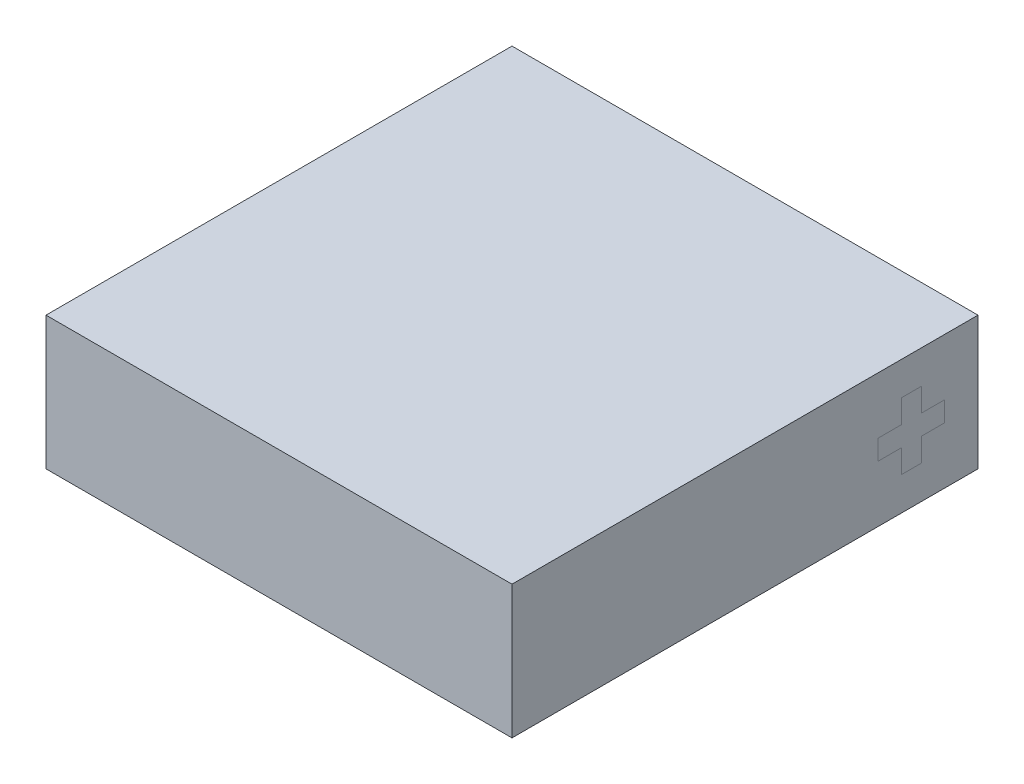
ISO-10303-21;
HEADER;
FILE_DESCRIPTION(('STEP AP214'),'2;1');
FILE_NAME('part.step','',(''),(''),'','','');
FILE_SCHEMA(('AUTOMOTIVE_DESIGN { 1 0 10303 214 1 1 1 1 }'));
ENDSEC;
DATA;
#1=APPLICATION_CONTEXT('core data for automotive mechanical design processes');
#2=APPLICATION_PROTOCOL_DEFINITION('international standard','automotive_design',2000,#1);
#3=PRODUCT_CONTEXT('',#1,'mechanical');
#4=PRODUCT('Part','Part','',(#3));
#5=PRODUCT_RELATED_PRODUCT_CATEGORY('part','',(#4));
#6=PRODUCT_DEFINITION_FORMATION('','',#4);
#7=PRODUCT_DEFINITION_CONTEXT('part definition',#1,'design');
#8=PRODUCT_DEFINITION('design','',#6,#7);
#9=PRODUCT_DEFINITION_SHAPE('','',#8);
#10=(LENGTH_UNIT() NAMED_UNIT(*) SI_UNIT(.MILLI.,.METRE.));
#11=(NAMED_UNIT(*) PLANE_ANGLE_UNIT() SI_UNIT($,.RADIAN.));
#12=(NAMED_UNIT(*) SI_UNIT($,.STERADIAN.) SOLID_ANGLE_UNIT());
#13=UNCERTAINTY_MEASURE_WITH_UNIT(LENGTH_MEASURE(1.E-05),#10,'distance_accuracy_value','');
#14=(GEOMETRIC_REPRESENTATION_CONTEXT(3) GLOBAL_UNCERTAINTY_ASSIGNED_CONTEXT((#13)) GLOBAL_UNIT_ASSIGNED_CONTEXT((#10,
#11,#12)) REPRESENTATION_CONTEXT('',''));
#15=CARTESIAN_POINT('',(0.,0.,0.));
#16=DIRECTION('',(0.,0.,1.));
#17=DIRECTION('',(1.,0.,0.));
#18=AXIS2_PLACEMENT_3D('',#15,#16,#17);
#19=CARTESIAN_POINT('',(3.5,2.,-3.5));
#20=DIRECTION('',(-1.,0.,0.));
#21=DIRECTION('',(0.,0.,1.));
#22=AXIS2_PLACEMENT_3D('',#19,#20,#21);
#23=PLANE('',#22);
#24=DIRECTION('',(0.,-1.,0.));
#25=VECTOR('',#24,1.);
#26=CARTESIAN_POINT('',(3.5,0.850000000000002,-2.35));
#27=LINE('',#26,#25);
#28=CARTESIAN_POINT('',(3.5,0.850000000000002,-2.35));
#29=VERTEX_POINT('',#28);
#30=CARTESIAN_POINT('',(3.5,0.500000000000002,-2.35));
#31=VERTEX_POINT('',#30);
#32=EDGE_CURVE('E457',#29,#31,#27,.T.);
#33=ORIENTED_EDGE('',*,*,#32,.T.);
#34=DIRECTION('',(0.,0.,-1.));
#35=VECTOR('',#34,1.);
#36=CARTESIAN_POINT('',(3.5,0.500000000000002,-2.35));
#37=LINE('',#36,#35);
#38=CARTESIAN_POINT('',(3.5,0.500000000000002,-2.65));
#39=VERTEX_POINT('',#38);
#40=EDGE_CURVE('E13',#31,#39,#37,.T.);
#41=ORIENTED_EDGE('',*,*,#40,.T.);
#42=DIRECTION('',(0.,1.,0.));
#43=VECTOR('',#42,1.);
#44=CARTESIAN_POINT('',(3.5,0.850000000000002,-2.65));
#45=LINE('',#44,#43);
#46=CARTESIAN_POINT('',(3.5,0.850000000000002,-2.65));
#47=VERTEX_POINT('',#46);
#48=EDGE_CURVE('E366',#39,#47,#45,.T.);
#49=ORIENTED_EDGE('',*,*,#48,.T.);
#50=DIRECTION('',(0.,0.,-1.));
#51=VECTOR('',#50,1.);
#52=CARTESIAN_POINT('',(3.5,0.850000000000002,-2.65));
#53=LINE('',#52,#51);
#54=CARTESIAN_POINT('',(3.5,0.850000000000002,-3.));
#55=VERTEX_POINT('',#54);
#56=EDGE_CURVE('E490',#47,#55,#53,.T.);
#57=ORIENTED_EDGE('',*,*,#56,.T.);
#58=DIRECTION('',(0.,1.,0.));
#59=VECTOR('',#58,1.);
#60=CARTESIAN_POINT('',(3.5,1.15,-3.));
#61=LINE('',#60,#59);
#62=CARTESIAN_POINT('',(3.5,1.15,-3.));
#63=VERTEX_POINT('',#62);
#64=EDGE_CURVE('E487',#55,#63,#61,.T.);
#65=ORIENTED_EDGE('',*,*,#64,.T.);
#66=DIRECTION('',(0.,0.,1.));
#67=VECTOR('',#66,1.);
#68=CARTESIAN_POINT('',(3.5,1.15,-2.65));
#69=LINE('',#68,#67);
#70=CARTESIAN_POINT('',(3.5,1.15,-2.65));
#71=VERTEX_POINT('',#70);
#72=EDGE_CURVE('E484',#63,#71,#69,.T.);
#73=ORIENTED_EDGE('',*,*,#72,.T.);
#74=DIRECTION('',(0.,1.,0.));
#75=VECTOR('',#74,1.);
#76=CARTESIAN_POINT('',(3.5,1.5,-2.65));
#77=LINE('',#76,#75);
#78=CARTESIAN_POINT('',(3.5,1.5,-2.65));
#79=VERTEX_POINT('',#78);
#80=EDGE_CURVE('E481',#71,#79,#77,.T.);
#81=ORIENTED_EDGE('',*,*,#80,.T.);
#82=DIRECTION('',(0.,0.,1.));
#83=VECTOR('',#82,1.);
#84=CARTESIAN_POINT('',(3.5,1.5,-2.35));
#85=LINE('',#84,#83);
#86=CARTESIAN_POINT('',(3.5,1.5,-2.35));
#87=VERTEX_POINT('',#86);
#88=EDGE_CURVE('E478',#79,#87,#85,.T.);
#89=ORIENTED_EDGE('',*,*,#88,.T.);
#90=DIRECTION('',(0.,-1.,0.));
#91=VECTOR('',#90,1.);
#92=CARTESIAN_POINT('',(3.5,1.5,-2.35));
#93=LINE('',#92,#91);
#94=CARTESIAN_POINT('',(3.5,1.15,-2.35));
#95=VERTEX_POINT('',#94);
#96=EDGE_CURVE('E475',#87,#95,#93,.T.);
#97=ORIENTED_EDGE('',*,*,#96,.T.);
#98=DIRECTION('',(0.,0.,1.));
#99=VECTOR('',#98,1.);
#100=CARTESIAN_POINT('',(3.5,1.15,-2.));
#101=LINE('',#100,#99);
#102=CARTESIAN_POINT('',(3.5,1.15,-2.));
#103=VERTEX_POINT('',#102);
#104=EDGE_CURVE('E473',#95,#103,#101,.T.);
#105=ORIENTED_EDGE('',*,*,#104,.T.);
#106=DIRECTION('',(0.,-1.,0.));
#107=VECTOR('',#106,1.);
#108=CARTESIAN_POINT('',(3.5,1.15,-2.));
#109=LINE('',#108,#107);
#110=CARTESIAN_POINT('',(3.5,0.850000000000002,-2.));
#111=VERTEX_POINT('',#110);
#112=EDGE_CURVE('E470',#103,#111,#109,.T.);
#113=ORIENTED_EDGE('',*,*,#112,.T.);
#114=DIRECTION('',(0.,0.,-1.));
#115=VECTOR('',#114,1.);
#116=CARTESIAN_POINT('',(3.5,0.850000000000002,-2.));
#117=LINE('',#116,#115);
#118=EDGE_CURVE('E462',#111,#29,#117,.T.);
#119=ORIENTED_EDGE('',*,*,#118,.T.);
#120=EDGE_LOOP('',(#33,#41,#49,#57,#65,#73,#81,#89,#97,#105,#113,#119));
#121=FACE_BOUND('',#120,.T.);
#122=ADVANCED_FACE('F357',(#121),#23,.F.);
#123=CARTESIAN_POINT('',(-3.5,2.,-3.5));
#124=DIRECTION('',(1.,0.,0.));
#125=DIRECTION('',(0.,0.,-1.));
#126=AXIS2_PLACEMENT_3D('',#123,#124,#125);
#127=PLANE('',#126);
#128=DIRECTION('',(0.,0.,1.));
#129=VECTOR('',#128,1.);
#130=CARTESIAN_POINT('',(-3.5,0.,-3.5));
#131=LINE('',#130,#129);
#132=CARTESIAN_POINT('',(-3.5,0.,-3.5));
#133=VERTEX_POINT('',#132);
#134=CARTESIAN_POINT('',(-3.5,0.,3.5));
#135=VERTEX_POINT('',#134);
#136=EDGE_CURVE('E455',#133,#135,#131,.T.);
#137=ORIENTED_EDGE('',*,*,#136,.T.);
#138=DIRECTION('',(0.,-1.,0.));
#139=VECTOR('',#138,1.);
#140=CARTESIAN_POINT('',(-3.5,2.,3.5));
#141=LINE('',#140,#139);
#142=CARTESIAN_POINT('',(-3.5,2.,3.5));
#143=VERTEX_POINT('',#142);
#144=EDGE_CURVE('E434',#143,#135,#141,.T.);
#145=ORIENTED_EDGE('',*,*,#144,.F.);
#146=DIRECTION('',(0.,0.,1.));
#147=VECTOR('',#146,1.);
#148=CARTESIAN_POINT('',(-3.5,2.,-3.5));
#149=LINE('',#148,#147);
#150=CARTESIAN_POINT('',(-3.5,2.,-3.5));
#151=VERTEX_POINT('',#150);
#152=EDGE_CURVE('E442',#151,#143,#149,.T.);
#153=ORIENTED_EDGE('',*,*,#152,.F.);
#154=DIRECTION('',(0.,-1.,0.));
#155=VECTOR('',#154,1.);
#156=CARTESIAN_POINT('',(-3.5,2.,-3.5));
#157=LINE('',#156,#155);
#158=EDGE_CURVE('E508',#151,#133,#157,.T.);
#159=ORIENTED_EDGE('',*,*,#158,.T.);
#160=EDGE_LOOP('',(#137,#145,#153,#159));
#161=FACE_BOUND('',#160,.T.);
#162=ADVANCED_FACE('F359',(#161),#127,.F.);
#163=CARTESIAN_POINT('',(-3.5,2.,3.5));
#164=DIRECTION('',(0.,0.,-1.));
#165=DIRECTION('',(-1.,0.,0.));
#166=AXIS2_PLACEMENT_3D('',#163,#164,#165);
#167=PLANE('',#166);
#168=DIRECTION('',(1.,0.,0.));
#169=VECTOR('',#168,1.);
#170=CARTESIAN_POINT('',(-3.5,0.,3.5));
#171=LINE('',#170,#169);
#172=CARTESIAN_POINT('',(3.5,0.,3.5));
#173=VERTEX_POINT('',#172);
#174=EDGE_CURVE('E512',#135,#173,#171,.T.);
#175=ORIENTED_EDGE('',*,*,#174,.T.);
#176=DIRECTION('',(0.,-1.,0.));
#177=VECTOR('',#176,1.);
#178=CARTESIAN_POINT('',(3.5,2.,3.5));
#179=LINE('',#178,#177);
#180=CARTESIAN_POINT('',(3.5,2.,3.5));
#181=VERTEX_POINT('',#180);
#182=EDGE_CURVE('E437',#181,#173,#179,.T.);
#183=ORIENTED_EDGE('',*,*,#182,.F.);
#184=DIRECTION('',(1.,0.,0.));
#185=VECTOR('',#184,1.);
#186=CARTESIAN_POINT('',(-3.5,2.,3.5));
#187=LINE('',#186,#185);
#188=EDGE_CURVE('E430',#143,#181,#187,.T.);
#189=ORIENTED_EDGE('',*,*,#188,.F.);
#190=ORIENTED_EDGE('',*,*,#144,.T.);
#191=EDGE_LOOP('',(#175,#183,#189,#190));
#192=FACE_BOUND('',#191,.T.);
#193=ADVANCED_FACE('F432',(#192),#167,.F.);
#194=ORIENTED_EDGE('',*,*,#40,.F.);
#195=ORIENTED_EDGE('',*,*,#32,.F.);
#196=ORIENTED_EDGE('',*,*,#118,.F.);
#197=ORIENTED_EDGE('',*,*,#112,.F.);
#198=ORIENTED_EDGE('',*,*,#104,.F.);
#199=ORIENTED_EDGE('',*,*,#96,.F.);
#200=ORIENTED_EDGE('',*,*,#88,.F.);
#201=ORIENTED_EDGE('',*,*,#80,.F.);
#202=ORIENTED_EDGE('',*,*,#72,.F.);
#203=ORIENTED_EDGE('',*,*,#64,.F.);
#204=ORIENTED_EDGE('',*,*,#56,.F.);
#205=ORIENTED_EDGE('',*,*,#48,.F.);
#206=EDGE_LOOP('',(#194,#195,#196,#197,#198,#199,#200,#201,#202,#203,#204,#205));
#207=FACE_BOUND('',#206,.T.);
#208=DIRECTION('',(0.,0.,-1.));
#209=VECTOR('',#208,1.);
#210=CARTESIAN_POINT('',(3.5,0.,-3.5));
#211=LINE('',#210,#209);
#212=CARTESIAN_POINT('',(3.5,0.,-3.5));
#213=VERTEX_POINT('',#212);
#214=EDGE_CURVE('E511',#173,#213,#211,.T.);
#215=ORIENTED_EDGE('',*,*,#214,.T.);
#216=DIRECTION('',(0.,-1.,0.));
#217=VECTOR('',#216,1.);
#218=CARTESIAN_POINT('',(3.5,2.,-3.5));
#219=LINE('',#218,#217);
#220=CARTESIAN_POINT('',(3.5,2.,-3.5));
#221=VERTEX_POINT('',#220);
#222=EDGE_CURVE('E464',#221,#213,#219,.T.);
#223=ORIENTED_EDGE('',*,*,#222,.F.);
#224=DIRECTION('',(0.,0.,-1.));
#225=VECTOR('',#224,1.);
#226=CARTESIAN_POINT('',(3.5,2.,-3.5));
#227=LINE('',#226,#225);
#228=EDGE_CURVE('E441',#181,#221,#227,.T.);
#229=ORIENTED_EDGE('',*,*,#228,.F.);
#230=ORIENTED_EDGE('',*,*,#182,.T.);
#231=EDGE_LOOP('',(#215,#223,#229,#230));
#232=FACE_BOUND('',#231,.T.);
#233=ADVANCED_FACE('F556',(#207,#232),#23,.F.);
#234=CARTESIAN_POINT('',(-3.5,2.,-3.5));
#235=DIRECTION('',(0.,0.,1.));
#236=DIRECTION('',(1.,0.,0.));
#237=AXIS2_PLACEMENT_3D('',#234,#235,#236);
#238=PLANE('',#237);
#239=DIRECTION('',(-1.,0.,0.));
#240=VECTOR('',#239,1.);
#241=CARTESIAN_POINT('',(-3.5,0.,-3.5));
#242=LINE('',#241,#240);
#243=EDGE_CURVE('E452',#213,#133,#242,.T.);
#244=ORIENTED_EDGE('',*,*,#243,.T.);
#245=ORIENTED_EDGE('',*,*,#158,.F.);
#246=DIRECTION('',(-1.,0.,0.));
#247=VECTOR('',#246,1.);
#248=CARTESIAN_POINT('',(-3.5,2.,-3.5));
#249=LINE('',#248,#247);
#250=EDGE_CURVE('E447',#221,#151,#249,.T.);
#251=ORIENTED_EDGE('',*,*,#250,.F.);
#252=ORIENTED_EDGE('',*,*,#222,.T.);
#253=EDGE_LOOP('',(#244,#245,#251,#252));
#254=FACE_BOUND('',#253,.T.);
#255=ADVANCED_FACE('F551',(#254),#238,.F.);
#256=CARTESIAN_POINT('',(0.,2.,0.));
#257=DIRECTION('',(0.,1.,0.));
#258=DIRECTION('',(0.,0.,1.));
#259=AXIS2_PLACEMENT_3D('',#256,#257,#258);
#260=PLANE('',#259);
#261=ORIENTED_EDGE('',*,*,#152,.T.);
#262=ORIENTED_EDGE('',*,*,#188,.T.);
#263=ORIENTED_EDGE('',*,*,#228,.T.);
#264=ORIENTED_EDGE('',*,*,#250,.T.);
#265=EDGE_LOOP('',(#261,#262,#263,#264));
#266=FACE_BOUND('',#265,.T.);
#267=ADVANCED_FACE('F445',(#266),#260,.T.);
#268=CARTESIAN_POINT('',(0.,0.,0.));
#269=DIRECTION('',(0.,1.,0.));
#270=DIRECTION('',(0.,0.,1.));
#271=AXIS2_PLACEMENT_3D('',#268,#269,#270);
#272=PLANE('',#271);
#273=ORIENTED_EDGE('',*,*,#136,.F.);
#274=ORIENTED_EDGE('',*,*,#243,.F.);
#275=ORIENTED_EDGE('',*,*,#214,.F.);
#276=ORIENTED_EDGE('',*,*,#174,.F.);
#277=EDGE_LOOP('',(#273,#274,#275,#276));
#278=FACE_BOUND('',#277,.T.);
#279=ADVANCED_FACE('F555',(#278),#272,.F.);
#280=CLOSED_SHELL('',(#122,#162,#193,#233,#255,#267,#279));
#281=MANIFOLD_SOLID_BREP('B2',#280);
#282=ADVANCED_BREP_SHAPE_REPRESENTATION('',(#18,#281),#14);
#283=SHAPE_DEFINITION_REPRESENTATION(#9,#282);
ENDSEC;
END-ISO-10303-21;
